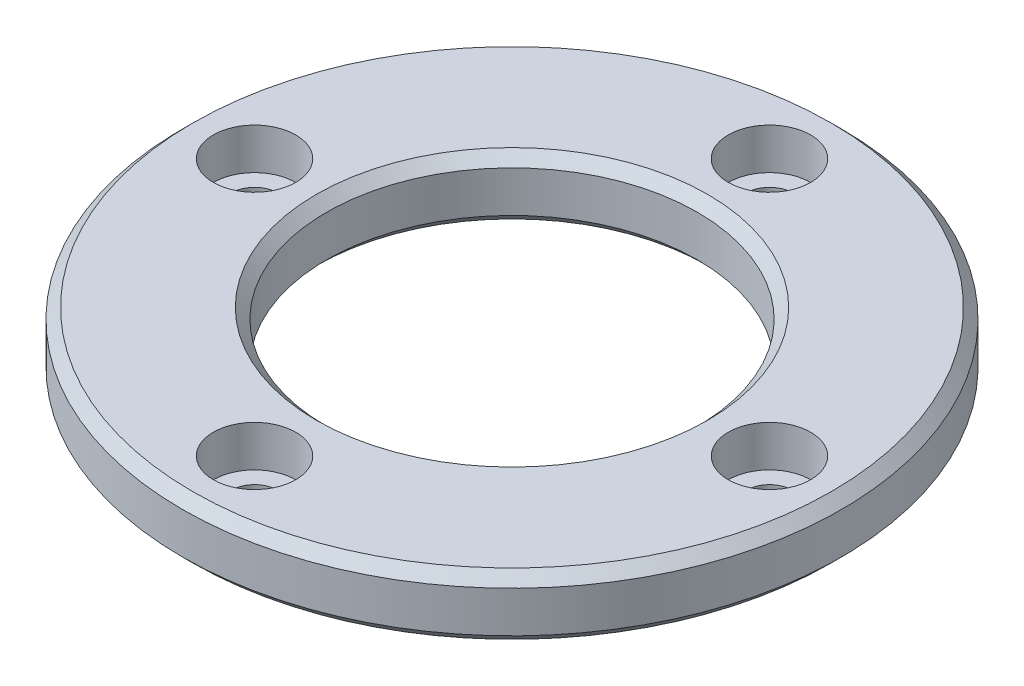
ISO-10303-21;
HEADER;
FILE_DESCRIPTION(('STEP AP214'),'2;1');
FILE_NAME('part.step','',(''),(''),'','','');
FILE_SCHEMA(('AUTOMOTIVE_DESIGN { 1 0 10303 214 1 1 1 1 }'));
ENDSEC;
DATA;
#1=APPLICATION_CONTEXT('core data for automotive mechanical design processes');
#2=APPLICATION_PROTOCOL_DEFINITION('international standard','automotive_design',2000,#1);
#3=PRODUCT_CONTEXT('',#1,'mechanical');
#4=PRODUCT('Part','Part','',(#3));
#5=PRODUCT_RELATED_PRODUCT_CATEGORY('part','',(#4));
#6=PRODUCT_DEFINITION_FORMATION('','',#4);
#7=PRODUCT_DEFINITION_CONTEXT('part definition',#1,'design');
#8=PRODUCT_DEFINITION('design','',#6,#7);
#9=PRODUCT_DEFINITION_SHAPE('','',#8);
#10=(LENGTH_UNIT() NAMED_UNIT(*) SI_UNIT(.MILLI.,.METRE.));
#11=(NAMED_UNIT(*) PLANE_ANGLE_UNIT() SI_UNIT($,.RADIAN.));
#12=(NAMED_UNIT(*) SI_UNIT($,.STERADIAN.) SOLID_ANGLE_UNIT());
#13=UNCERTAINTY_MEASURE_WITH_UNIT(LENGTH_MEASURE(1.E-05),#10,'distance_accuracy_value','');
#14=(GEOMETRIC_REPRESENTATION_CONTEXT(3) GLOBAL_UNCERTAINTY_ASSIGNED_CONTEXT((#13)) GLOBAL_UNIT_ASSIGNED_CONTEXT((#10,
#11,#12)) REPRESENTATION_CONTEXT('',''));
#15=CARTESIAN_POINT('',(0.,0.,0.));
#16=DIRECTION('',(0.,0.,1.));
#17=DIRECTION('',(1.,0.,0.));
#18=AXIS2_PLACEMENT_3D('',#15,#16,#17);
#19=CARTESIAN_POINT('',(0.,-3.,0.));
#20=DIRECTION('',(0.,1.,0.));
#21=DIRECTION('',(0.,0.,1.));
#22=AXIS2_PLACEMENT_3D('',#19,#20,#21);
#23=PLANE('',#22);
#24=CARTESIAN_POINT('',(25.,-3.,0.));
#25=DIRECTION('',(0.,1.,0.));
#26=DIRECTION('',(0.,0.,1.));
#27=AXIS2_PLACEMENT_3D('',#24,#25,#26);
#28=CIRCLE('',#27,2.99999999999999);
#29=CARTESIAN_POINT('',(25.,-3.,3.));
#30=VERTEX_POINT('',#29);
#31=EDGE_CURVE('E69',#30,#30,#28,.F.);
#32=ORIENTED_EDGE('',*,*,#31,.F.);
#33=EDGE_LOOP('',(#32));
#34=FACE_BOUND('',#33,.T.);
#35=CARTESIAN_POINT('',(-25.,-3.,0.));
#36=DIRECTION('',(0.,1.,0.));
#37=DIRECTION('',(0.,0.,1.));
#38=AXIS2_PLACEMENT_3D('',#35,#36,#37);
#39=CIRCLE('',#38,2.99999999999999);
#40=CARTESIAN_POINT('',(-25.,-3.,2.99999999999999));
#41=VERTEX_POINT('',#40);
#42=EDGE_CURVE('E81',#41,#41,#39,.F.);
#43=ORIENTED_EDGE('',*,*,#42,.F.);
#44=EDGE_LOOP('',(#43));
#45=FACE_BOUND('',#44,.T.);
#46=CARTESIAN_POINT('',(0.,-3.,0.));
#47=DIRECTION('',(0.,1.,0.));
#48=DIRECTION('',(0.,0.,1.));
#49=AXIS2_PLACEMENT_3D('',#46,#47,#48);
#50=CIRCLE('',#49,31.);
#51=CARTESIAN_POINT('',(0.,-3.,31.));
#52=VERTEX_POINT('',#51);
#53=EDGE_CURVE('E96',#52,#52,#50,.F.);
#54=ORIENTED_EDGE('',*,*,#53,.T.);
#55=EDGE_LOOP('',(#54));
#56=FACE_BOUND('',#55,.T.);
#57=CARTESIAN_POINT('',(0.,-3.,0.));
#58=DIRECTION('',(0.,1.,0.));
#59=DIRECTION('',(0.,0.,1.));
#60=AXIS2_PLACEMENT_3D('',#57,#58,#59);
#61=CIRCLE('',#60,19.);
#62=CARTESIAN_POINT('',(0.,-3.,19.));
#63=VERTEX_POINT('',#62);
#64=EDGE_CURVE('E99',#63,#63,#61,.T.);
#65=ORIENTED_EDGE('',*,*,#64,.T.);
#66=EDGE_LOOP('',(#65));
#67=FACE_BOUND('',#66,.T.);
#68=CARTESIAN_POINT('',(-2.60330291914301E-13,-3.,-25.));
#69=DIRECTION('',(0.,1.,0.));
#70=DIRECTION('',(0.,0.,1.));
#71=AXIS2_PLACEMENT_3D('',#68,#69,#70);
#72=CIRCLE('',#71,2.99999999999999);
#73=CARTESIAN_POINT('',(-2.60330291914301E-13,-3.,-22.));
#74=VERTEX_POINT('',#73);
#75=EDGE_CURVE('E72',#74,#74,#72,.F.);
#76=ORIENTED_EDGE('',*,*,#75,.F.);
#77=EDGE_LOOP('',(#76));
#78=FACE_BOUND('',#77,.T.);
#79=CARTESIAN_POINT('',(0.,-3.,25.));
#80=DIRECTION('',(0.,1.,0.));
#81=DIRECTION('',(0.,0.,1.));
#82=AXIS2_PLACEMENT_3D('',#79,#80,#81);
#83=CIRCLE('',#82,2.99999999999999);
#84=CARTESIAN_POINT('',(0.,-3.,28.));
#85=VERTEX_POINT('',#84);
#86=EDGE_CURVE('E66',#85,#85,#83,.F.);
#87=ORIENTED_EDGE('',*,*,#86,.F.);
#88=EDGE_LOOP('',(#87));
#89=FACE_BOUND('',#88,.T.);
#90=ADVANCED_FACE('F39',(#34,#45,#56,#67,#78,#89),#23,.F.);
#91=CARTESIAN_POINT('',(0.,3.,0.));
#92=DIRECTION('',(0.,1.,0.));
#93=DIRECTION('',(0.,0.,1.));
#94=AXIS2_PLACEMENT_3D('',#91,#92,#93);
#95=PLANE('',#94);
#96=CARTESIAN_POINT('',(0.,3.,0.));
#97=DIRECTION('',(0.,1.,0.));
#98=DIRECTION('',(0.,0.,1.));
#99=AXIS2_PLACEMENT_3D('',#96,#97,#98);
#100=CIRCLE('',#99,31.);
#101=CARTESIAN_POINT('',(0.,3.,31.));
#102=VERTEX_POINT('',#101);
#103=EDGE_CURVE('E90',#102,#102,#100,.T.);
#104=ORIENTED_EDGE('',*,*,#103,.T.);
#105=EDGE_LOOP('',(#104));
#106=FACE_BOUND('',#105,.T.);
#107=CARTESIAN_POINT('',(0.,3.,0.));
#108=DIRECTION('',(0.,1.,0.));
#109=DIRECTION('',(0.,0.,1.));
#110=AXIS2_PLACEMENT_3D('',#107,#108,#109);
#111=CIRCLE('',#110,19.);
#112=CARTESIAN_POINT('',(0.,3.,19.));
#113=VERTEX_POINT('',#112);
#114=EDGE_CURVE('E93',#113,#113,#111,.F.);
#115=ORIENTED_EDGE('',*,*,#114,.T.);
#116=EDGE_LOOP('',(#115));
#117=FACE_BOUND('',#116,.T.);
#118=CARTESIAN_POINT('',(0.,3.,-25.));
#119=DIRECTION('',(0.,1.,0.));
#120=DIRECTION('',(0.,0.,1.));
#121=AXIS2_PLACEMENT_3D('',#118,#119,#120);
#122=CIRCLE('',#121,3.99999999999999);
#123=CARTESIAN_POINT('',(0.,3.,-21.));
#124=VERTEX_POINT('',#123);
#125=EDGE_CURVE('E141',#124,#124,#122,.T.);
#126=ORIENTED_EDGE('',*,*,#125,.F.);
#127=EDGE_LOOP('',(#126));
#128=FACE_BOUND('',#127,.T.);
#129=CARTESIAN_POINT('',(25.,3.,0.));
#130=DIRECTION('',(0.,1.,0.));
#131=DIRECTION('',(0.,0.,1.));
#132=AXIS2_PLACEMENT_3D('',#129,#130,#131);
#133=CIRCLE('',#132,3.99999999999999);
#134=CARTESIAN_POINT('',(25.,3.,3.99999999999999));
#135=VERTEX_POINT('',#134);
#136=EDGE_CURVE('E132',#135,#135,#133,.T.);
#137=ORIENTED_EDGE('',*,*,#136,.F.);
#138=EDGE_LOOP('',(#137));
#139=FACE_BOUND('',#138,.T.);
#140=CARTESIAN_POINT('',(0.,3.,25.));
#141=DIRECTION('',(0.,1.,0.));
#142=DIRECTION('',(0.,0.,1.));
#143=AXIS2_PLACEMENT_3D('',#140,#141,#142);
#144=CIRCLE('',#143,3.99999999999999);
#145=CARTESIAN_POINT('',(0.,3.,29.));
#146=VERTEX_POINT('',#145);
#147=EDGE_CURVE('E123',#146,#146,#144,.T.);
#148=ORIENTED_EDGE('',*,*,#147,.F.);
#149=EDGE_LOOP('',(#148));
#150=FACE_BOUND('',#149,.T.);
#151=CARTESIAN_POINT('',(-25.,3.,0.));
#152=DIRECTION('',(0.,1.,0.));
#153=DIRECTION('',(0.,0.,1.));
#154=AXIS2_PLACEMENT_3D('',#151,#152,#153);
#155=CIRCLE('',#154,3.99999999999999);
#156=CARTESIAN_POINT('',(-25.,3.,3.99999999999999));
#157=VERTEX_POINT('',#156);
#158=EDGE_CURVE('E114',#157,#157,#155,.T.);
#159=ORIENTED_EDGE('',*,*,#158,.F.);
#160=EDGE_LOOP('',(#159));
#161=FACE_BOUND('',#160,.T.);
#162=ADVANCED_FACE('F176',(#106,#117,#128,#139,#150,#161),#95,.T.);
#163=CARTESIAN_POINT('',(0.,3.,0.));
#164=DIRECTION('',(0.,-1.,0.));
#165=DIRECTION('',(0.,0.,-1.));
#166=AXIS2_PLACEMENT_3D('',#163,#164,#165);
#167=CYLINDRICAL_SURFACE('',#166,32.);
#168=CARTESIAN_POINT('',(0.,-2.00000000000001,0.));
#169=DIRECTION('',(0.,1.,0.));
#170=DIRECTION('',(0.,0.,1.));
#171=AXIS2_PLACEMENT_3D('',#168,#169,#170);
#172=CIRCLE('',#171,32.);
#173=CARTESIAN_POINT('',(0.,-2.00000000000001,32.));
#174=VERTEX_POINT('',#173);
#175=EDGE_CURVE('E102',#174,#174,#172,.T.);
#176=ORIENTED_EDGE('',*,*,#175,.T.);
#177=EDGE_LOOP('',(#176));
#178=FACE_BOUND('',#177,.T.);
#179=CARTESIAN_POINT('',(0.,1.99999999999997,0.));
#180=DIRECTION('',(0.,1.,0.));
#181=DIRECTION('',(0.,0.,1.));
#182=AXIS2_PLACEMENT_3D('',#179,#180,#181);
#183=CIRCLE('',#182,32.);
#184=CARTESIAN_POINT('',(0.,1.99999999999997,32.));
#185=VERTEX_POINT('',#184);
#186=EDGE_CURVE('E105',#185,#185,#183,.F.);
#187=ORIENTED_EDGE('',*,*,#186,.T.);
#188=EDGE_LOOP('',(#187));
#189=FACE_BOUND('',#188,.T.);
#190=ADVANCED_FACE('F184',(#178,#189),#167,.T.);
#191=CARTESIAN_POINT('',(0.,3.,0.));
#192=DIRECTION('',(0.,-1.,0.));
#193=DIRECTION('',(0.,0.,-1.));
#194=AXIS2_PLACEMENT_3D('',#191,#192,#193);
#195=CYLINDRICAL_SURFACE('',#194,18.);
#196=CARTESIAN_POINT('',(0.,-2.00000000000001,0.));
#197=DIRECTION('',(0.,1.,0.));
#198=DIRECTION('',(0.,0.,1.));
#199=AXIS2_PLACEMENT_3D('',#196,#197,#198);
#200=CIRCLE('',#199,18.);
#201=CARTESIAN_POINT('',(0.,-2.00000000000001,18.));
#202=VERTEX_POINT('',#201);
#203=EDGE_CURVE('E84',#202,#202,#200,.F.);
#204=ORIENTED_EDGE('',*,*,#203,.T.);
#205=EDGE_LOOP('',(#204));
#206=FACE_BOUND('',#205,.T.);
#207=CARTESIAN_POINT('',(0.,2.,0.));
#208=DIRECTION('',(0.,1.,0.));
#209=DIRECTION('',(0.,0.,1.));
#210=AXIS2_PLACEMENT_3D('',#207,#208,#209);
#211=CIRCLE('',#210,18.);
#212=CARTESIAN_POINT('',(0.,2.,18.));
#213=VERTEX_POINT('',#212);
#214=EDGE_CURVE('E87',#213,#213,#211,.T.);
#215=ORIENTED_EDGE('',*,*,#214,.T.);
#216=EDGE_LOOP('',(#215));
#217=FACE_BOUND('',#216,.T.);
#218=ADVANCED_FACE('F193',(#206,#217),#195,.F.);
#219=CARTESIAN_POINT('',(-25.,3.,0.));
#220=DIRECTION('',(0.,1.,0.));
#221=DIRECTION('',(0.,0.,1.));
#222=AXIS2_PLACEMENT_3D('',#219,#220,#221);
#223=CYLINDRICAL_SURFACE('',#222,2.25);
#224=CARTESIAN_POINT('',(-25.,-1.,0.));
#225=DIRECTION('',(0.,1.,0.));
#226=DIRECTION('',(0.,0.,1.));
#227=AXIS2_PLACEMENT_3D('',#224,#225,#226);
#228=CIRCLE('',#227,2.25);
#229=CARTESIAN_POINT('',(-25.,-1.,2.25));
#230=VERTEX_POINT('',#229);
#231=EDGE_CURVE('E108',#230,#230,#228,.T.);
#232=ORIENTED_EDGE('',*,*,#231,.T.);
#233=EDGE_LOOP('',(#232));
#234=FACE_BOUND('',#233,.T.);
#235=CARTESIAN_POINT('',(-25.,-5.,0.));
#236=DIRECTION('',(0.,-1.,0.));
#237=DIRECTION('',(0.,0.,-1.));
#238=AXIS2_PLACEMENT_3D('',#235,#236,#237);
#239=CIRCLE('',#238,2.25);
#240=CARTESIAN_POINT('',(-25.,-5.,-2.25));
#241=VERTEX_POINT('',#240);
#242=EDGE_CURVE('E144',#241,#241,#239,.T.);
#243=ORIENTED_EDGE('',*,*,#242,.T.);
#244=EDGE_LOOP('',(#243));
#245=FACE_BOUND('',#244,.T.);
#246=ADVANCED_FACE('F289',(#234,#245),#223,.F.);
#247=CARTESIAN_POINT('',(-22.75,-1.,0.));
#248=DIRECTION('',(0.,-1.,0.));
#249=DIRECTION('',(0.,0.,-1.));
#250=AXIS2_PLACEMENT_3D('',#247,#248,#249);
#251=PLANE('',#250);
#252=ORIENTED_EDGE('',*,*,#231,.F.);
#253=EDGE_LOOP('',(#252));
#254=FACE_BOUND('',#253,.T.);
#255=CARTESIAN_POINT('',(-25.,-1.,0.));
#256=DIRECTION('',(0.,1.,0.));
#257=DIRECTION('',(0.,0.,1.));
#258=AXIS2_PLACEMENT_3D('',#255,#256,#257);
#259=CIRCLE('',#258,4.);
#260=CARTESIAN_POINT('',(-25.,-1.,3.99999999999999));
#261=VERTEX_POINT('',#260);
#262=EDGE_CURVE('E111',#261,#261,#259,.T.);
#263=ORIENTED_EDGE('',*,*,#262,.T.);
#264=EDGE_LOOP('',(#263));
#265=FACE_BOUND('',#264,.T.);
#266=ADVANCED_FACE('F285',(#254,#265),#251,.F.);
#267=CARTESIAN_POINT('',(-25.,3.,0.));
#268=DIRECTION('',(0.,1.,0.));
#269=DIRECTION('',(0.,0.,1.));
#270=AXIS2_PLACEMENT_3D('',#267,#268,#269);
#271=CYLINDRICAL_SURFACE('',#270,3.99999999999999);
#272=ORIENTED_EDGE('',*,*,#262,.F.);
#273=EDGE_LOOP('',(#272));
#274=FACE_BOUND('',#273,.T.);
#275=ORIENTED_EDGE('',*,*,#158,.T.);
#276=EDGE_LOOP('',(#275));
#277=FACE_BOUND('',#276,.T.);
#278=ADVANCED_FACE('F281',(#274,#277),#271,.F.);
#279=CARTESIAN_POINT('',(0.,3.,25.));
#280=DIRECTION('',(0.,1.,0.));
#281=DIRECTION('',(0.,0.,1.));
#282=AXIS2_PLACEMENT_3D('',#279,#280,#281);
#283=CYLINDRICAL_SURFACE('',#282,2.25);
#284=CARTESIAN_POINT('',(0.,-1.,25.));
#285=DIRECTION('',(0.,1.,0.));
#286=DIRECTION('',(0.,0.,1.));
#287=AXIS2_PLACEMENT_3D('',#284,#285,#286);
#288=CIRCLE('',#287,2.25);
#289=CARTESIAN_POINT('',(0.,-1.,27.25));
#290=VERTEX_POINT('',#289);
#291=EDGE_CURVE('E117',#290,#290,#288,.T.);
#292=ORIENTED_EDGE('',*,*,#291,.T.);
#293=EDGE_LOOP('',(#292));
#294=FACE_BOUND('',#293,.T.);
#295=CARTESIAN_POINT('',(0.,-5.,25.));
#296=DIRECTION('',(0.,-1.,0.));
#297=DIRECTION('',(-1.,0.,0.));
#298=AXIS2_PLACEMENT_3D('',#295,#296,#297);
#299=CIRCLE('',#298,2.25);
#300=CARTESIAN_POINT('',(-2.24999999999991,-5.,25.));
#301=VERTEX_POINT('',#300);
#302=EDGE_CURVE('E147',#301,#301,#299,.T.);
#303=ORIENTED_EDGE('',*,*,#302,.T.);
#304=EDGE_LOOP('',(#303));
#305=FACE_BOUND('',#304,.T.);
#306=ADVANCED_FACE('F157',(#294,#305),#283,.F.);
#307=CARTESIAN_POINT('',(2.25,-1.,25.));
#308=DIRECTION('',(0.,-1.,0.));
#309=DIRECTION('',(0.,0.,-1.));
#310=AXIS2_PLACEMENT_3D('',#307,#308,#309);
#311=PLANE('',#310);
#312=ORIENTED_EDGE('',*,*,#291,.F.);
#313=EDGE_LOOP('',(#312));
#314=FACE_BOUND('',#313,.T.);
#315=CARTESIAN_POINT('',(0.,-1.,25.));
#316=DIRECTION('',(0.,1.,0.));
#317=DIRECTION('',(0.,0.,1.));
#318=AXIS2_PLACEMENT_3D('',#315,#316,#317);
#319=CIRCLE('',#318,4.);
#320=CARTESIAN_POINT('',(0.,-1.,29.));
#321=VERTEX_POINT('',#320);
#322=EDGE_CURVE('E120',#321,#321,#319,.T.);
#323=ORIENTED_EDGE('',*,*,#322,.T.);
#324=EDGE_LOOP('',(#323));
#325=FACE_BOUND('',#324,.T.);
#326=ADVANCED_FACE('F272',(#314,#325),#311,.F.);
#327=CARTESIAN_POINT('',(0.,3.,25.));
#328=DIRECTION('',(0.,1.,0.));
#329=DIRECTION('',(0.,0.,1.));
#330=AXIS2_PLACEMENT_3D('',#327,#328,#329);
#331=CYLINDRICAL_SURFACE('',#330,3.99999999999999);
#332=ORIENTED_EDGE('',*,*,#322,.F.);
#333=EDGE_LOOP('',(#332));
#334=FACE_BOUND('',#333,.T.);
#335=ORIENTED_EDGE('',*,*,#147,.T.);
#336=EDGE_LOOP('',(#335));
#337=FACE_BOUND('',#336,.T.);
#338=ADVANCED_FACE('F261',(#334,#337),#331,.F.);
#339=CARTESIAN_POINT('',(25.,3.,0.));
#340=DIRECTION('',(0.,1.,0.));
#341=DIRECTION('',(0.,0.,1.));
#342=AXIS2_PLACEMENT_3D('',#339,#340,#341);
#343=CYLINDRICAL_SURFACE('',#342,2.25);
#344=CARTESIAN_POINT('',(25.,-1.,0.));
#345=DIRECTION('',(0.,1.,0.));
#346=DIRECTION('',(0.,0.,1.));
#347=AXIS2_PLACEMENT_3D('',#344,#345,#346);
#348=CIRCLE('',#347,2.25);
#349=CARTESIAN_POINT('',(25.,-1.,2.25));
#350=VERTEX_POINT('',#349);
#351=EDGE_CURVE('E126',#350,#350,#348,.T.);
#352=ORIENTED_EDGE('',*,*,#351,.T.);
#353=EDGE_LOOP('',(#352));
#354=FACE_BOUND('',#353,.T.);
#355=CARTESIAN_POINT('',(25.,-5.,0.));
#356=DIRECTION('',(0.,-1.,0.));
#357=DIRECTION('',(0.,0.,1.));
#358=AXIS2_PLACEMENT_3D('',#355,#356,#357);
#359=CIRCLE('',#358,2.25);
#360=CARTESIAN_POINT('',(25.,-5.,2.25));
#361=VERTEX_POINT('',#360);
#362=EDGE_CURVE('E151',#361,#361,#359,.T.);
#363=ORIENTED_EDGE('',*,*,#362,.T.);
#364=EDGE_LOOP('',(#363));
#365=FACE_BOUND('',#364,.T.);
#366=ADVANCED_FACE('F258',(#354,#365),#343,.F.);
#367=CARTESIAN_POINT('',(27.25,-1.,0.));
#368=DIRECTION('',(0.,-1.,0.));
#369=DIRECTION('',(0.,0.,-1.));
#370=AXIS2_PLACEMENT_3D('',#367,#368,#369);
#371=PLANE('',#370);
#372=ORIENTED_EDGE('',*,*,#351,.F.);
#373=EDGE_LOOP('',(#372));
#374=FACE_BOUND('',#373,.T.);
#375=CARTESIAN_POINT('',(25.,-1.,0.));
#376=DIRECTION('',(0.,1.,0.));
#377=DIRECTION('',(0.,0.,1.));
#378=AXIS2_PLACEMENT_3D('',#375,#376,#377);
#379=CIRCLE('',#378,4.);
#380=CARTESIAN_POINT('',(25.,-1.,3.99999999999999));
#381=VERTEX_POINT('',#380);
#382=EDGE_CURVE('E129',#381,#381,#379,.T.);
#383=ORIENTED_EDGE('',*,*,#382,.T.);
#384=EDGE_LOOP('',(#383));
#385=FACE_BOUND('',#384,.T.);
#386=ADVANCED_FACE('F260',(#374,#385),#371,.F.);
#387=CARTESIAN_POINT('',(25.,3.,0.));
#388=DIRECTION('',(0.,1.,0.));
#389=DIRECTION('',(0.,0.,1.));
#390=AXIS2_PLACEMENT_3D('',#387,#388,#389);
#391=CYLINDRICAL_SURFACE('',#390,3.99999999999999);
#392=ORIENTED_EDGE('',*,*,#382,.F.);
#393=EDGE_LOOP('',(#392));
#394=FACE_BOUND('',#393,.T.);
#395=ORIENTED_EDGE('',*,*,#136,.T.);
#396=EDGE_LOOP('',(#395));
#397=FACE_BOUND('',#396,.T.);
#398=ADVANCED_FACE('F268',(#394,#397),#391,.F.);
#399=CARTESIAN_POINT('',(0.,3.,-25.));
#400=DIRECTION('',(0.,1.,0.));
#401=DIRECTION('',(0.,0.,1.));
#402=AXIS2_PLACEMENT_3D('',#399,#400,#401);
#403=CYLINDRICAL_SURFACE('',#402,2.25);
#404=CARTESIAN_POINT('',(0.,-1.,-25.));
#405=DIRECTION('',(0.,1.,0.));
#406=DIRECTION('',(0.,0.,1.));
#407=AXIS2_PLACEMENT_3D('',#404,#405,#406);
#408=CIRCLE('',#407,2.25);
#409=CARTESIAN_POINT('',(0.,-1.,-22.75));
#410=VERTEX_POINT('',#409);
#411=EDGE_CURVE('E135',#410,#410,#408,.T.);
#412=ORIENTED_EDGE('',*,*,#411,.T.);
#413=EDGE_LOOP('',(#412));
#414=FACE_BOUND('',#413,.T.);
#415=CARTESIAN_POINT('',(-2.60330291914301E-13,-5.,-25.));
#416=DIRECTION('',(0.,-1.,0.));
#417=DIRECTION('',(1.,0.,0.));
#418=AXIS2_PLACEMENT_3D('',#415,#416,#417);
#419=CIRCLE('',#418,2.25);
#420=CARTESIAN_POINT('',(2.24999999999974,-5.,-25.));
#421=VERTEX_POINT('',#420);
#422=EDGE_CURVE('E148',#421,#421,#419,.T.);
#423=ORIENTED_EDGE('',*,*,#422,.T.);
#424=EDGE_LOOP('',(#423));
#425=FACE_BOUND('',#424,.T.);
#426=ADVANCED_FACE('F329',(#414,#425),#403,.F.);
#427=CARTESIAN_POINT('',(2.25,-1.,-25.));
#428=DIRECTION('',(0.,-1.,0.));
#429=DIRECTION('',(0.,0.,-1.));
#430=AXIS2_PLACEMENT_3D('',#427,#428,#429);
#431=PLANE('',#430);
#432=ORIENTED_EDGE('',*,*,#411,.F.);
#433=EDGE_LOOP('',(#432));
#434=FACE_BOUND('',#433,.T.);
#435=CARTESIAN_POINT('',(0.,-1.,-25.));
#436=DIRECTION('',(0.,1.,0.));
#437=DIRECTION('',(0.,0.,1.));
#438=AXIS2_PLACEMENT_3D('',#435,#436,#437);
#439=CIRCLE('',#438,4.);
#440=CARTESIAN_POINT('',(0.,-1.,-21.));
#441=VERTEX_POINT('',#440);
#442=EDGE_CURVE('E138',#441,#441,#439,.T.);
#443=ORIENTED_EDGE('',*,*,#442,.T.);
#444=EDGE_LOOP('',(#443));
#445=FACE_BOUND('',#444,.T.);
#446=ADVANCED_FACE('F325',(#434,#445),#431,.F.);
#447=CARTESIAN_POINT('',(0.,3.,-25.));
#448=DIRECTION('',(0.,1.,0.));
#449=DIRECTION('',(0.,0.,1.));
#450=AXIS2_PLACEMENT_3D('',#447,#448,#449);
#451=CYLINDRICAL_SURFACE('',#450,3.99999999999999);
#452=ORIENTED_EDGE('',*,*,#442,.F.);
#453=EDGE_LOOP('',(#452));
#454=FACE_BOUND('',#453,.T.);
#455=ORIENTED_EDGE('',*,*,#125,.T.);
#456=EDGE_LOOP('',(#455));
#457=FACE_BOUND('',#456,.T.);
#458=ADVANCED_FACE('F203',(#454,#457),#451,.F.);
#459=CARTESIAN_POINT('',(0.,-2.00000000000001,0.));
#460=DIRECTION('',(0.,1.,0.));
#461=DIRECTION('',(0.,0.,1.));
#462=AXIS2_PLACEMENT_3D('',#459,#460,#461);
#463=CONICAL_SURFACE('',#462,32.,0.785398163397448);
#464=ORIENTED_EDGE('',*,*,#53,.F.);
#465=EDGE_LOOP('',(#464));
#466=FACE_BOUND('',#465,.T.);
#467=ORIENTED_EDGE('',*,*,#175,.F.);
#468=EDGE_LOOP('',(#467));
#469=FACE_BOUND('',#468,.T.);
#470=ADVANCED_FACE('F196',(#466,#469),#463,.T.);
#471=CARTESIAN_POINT('',(0.,3.,0.));
#472=DIRECTION('',(0.,-1.,0.));
#473=DIRECTION('',(0.,0.,-1.));
#474=AXIS2_PLACEMENT_3D('',#471,#472,#473);
#475=CONICAL_SURFACE('',#474,31.,0.785398163397441);
#476=ORIENTED_EDGE('',*,*,#186,.F.);
#477=EDGE_LOOP('',(#476));
#478=FACE_BOUND('',#477,.T.);
#479=ORIENTED_EDGE('',*,*,#103,.F.);
#480=EDGE_LOOP('',(#479));
#481=FACE_BOUND('',#480,.T.);
#482=ADVANCED_FACE('F202',(#478,#481),#475,.T.);
#483=CARTESIAN_POINT('',(0.,-3.,0.));
#484=DIRECTION('',(0.,-1.,0.));
#485=DIRECTION('',(0.,0.,-1.));
#486=AXIS2_PLACEMENT_3D('',#483,#484,#485);
#487=CONICAL_SURFACE('',#486,19.,0.785398163397448);
#488=ORIENTED_EDGE('',*,*,#203,.F.);
#489=EDGE_LOOP('',(#488));
#490=FACE_BOUND('',#489,.T.);
#491=ORIENTED_EDGE('',*,*,#64,.F.);
#492=EDGE_LOOP('',(#491));
#493=FACE_BOUND('',#492,.T.);
#494=ADVANCED_FACE('F210',(#490,#493),#487,.F.);
#495=CARTESIAN_POINT('',(0.,2.,0.));
#496=DIRECTION('',(0.,1.,0.));
#497=DIRECTION('',(0.,0.,1.));
#498=AXIS2_PLACEMENT_3D('',#495,#496,#497);
#499=CONICAL_SURFACE('',#498,18.,0.785398163397452);
#500=ORIENTED_EDGE('',*,*,#114,.F.);
#501=EDGE_LOOP('',(#500));
#502=FACE_BOUND('',#501,.T.);
#503=ORIENTED_EDGE('',*,*,#214,.F.);
#504=EDGE_LOOP('',(#503));
#505=FACE_BOUND('',#504,.T.);
#506=ADVANCED_FACE('F217',(#502,#505),#499,.F.);
#507=CARTESIAN_POINT('',(-25.,-5.,0.));
#508=DIRECTION('',(0.,-1.,0.));
#509=DIRECTION('',(0.,0.,-1.));
#510=AXIS2_PLACEMENT_3D('',#507,#508,#509);
#511=PLANE('',#510);
#512=CARTESIAN_POINT('',(-25.,-5.,0.));
#513=DIRECTION('',(0.,-1.,0.));
#514=DIRECTION('',(0.,0.,-1.));
#515=AXIS2_PLACEMENT_3D('',#512,#513,#514);
#516=CIRCLE('',#515,2.8);
#517=CARTESIAN_POINT('',(-25.,-5.,-2.8));
#518=VERTEX_POINT('',#517);
#519=EDGE_CURVE('E78',#518,#518,#516,.T.);
#520=ORIENTED_EDGE('',*,*,#519,.T.);
#521=EDGE_LOOP('',(#520));
#522=FACE_BOUND('',#521,.T.);
#523=ORIENTED_EDGE('',*,*,#242,.F.);
#524=EDGE_LOOP('',(#523));
#525=FACE_BOUND('',#524,.T.);
#526=ADVANCED_FACE('F224',(#522,#525),#511,.T.);
#527=CARTESIAN_POINT('',(-25.,-5.,0.));
#528=DIRECTION('',(0.,1.,0.));
#529=DIRECTION('',(0.,0.,1.));
#530=AXIS2_PLACEMENT_3D('',#527,#528,#529);
#531=CYLINDRICAL_SURFACE('',#530,2.99999999999999);
#532=CARTESIAN_POINT('',(-25.,-4.8,0.));
#533=DIRECTION('',(0.,-1.,0.));
#534=DIRECTION('',(0.,0.,-1.));
#535=AXIS2_PLACEMENT_3D('',#532,#533,#534);
#536=CIRCLE('',#535,2.99999999999999);
#537=CARTESIAN_POINT('',(-25.,-4.8,-3.));
#538=VERTEX_POINT('',#537);
#539=EDGE_CURVE('E75',#538,#538,#536,.F.);
#540=ORIENTED_EDGE('',*,*,#539,.T.);
#541=EDGE_LOOP('',(#540));
#542=FACE_BOUND('',#541,.T.);
#543=ORIENTED_EDGE('',*,*,#42,.T.);
#544=EDGE_LOOP('',(#543));
#545=FACE_BOUND('',#544,.T.);
#546=ADVANCED_FACE('F232',(#542,#545),#531,.T.);
#547=CARTESIAN_POINT('',(-25.,-5.,0.));
#548=DIRECTION('',(0.,1.,0.));
#549=DIRECTION('',(0.,0.,1.));
#550=AXIS2_PLACEMENT_3D('',#547,#548,#549);
#551=CONICAL_SURFACE('',#550,2.8,0.785398163397444);
#552=ORIENTED_EDGE('',*,*,#539,.F.);
#553=EDGE_LOOP('',(#552));
#554=FACE_BOUND('',#553,.T.);
#555=ORIENTED_EDGE('',*,*,#519,.F.);
#556=EDGE_LOOP('',(#555));
#557=FACE_BOUND('',#556,.T.);
#558=ADVANCED_FACE('F226',(#554,#557),#551,.T.);
#559=CARTESIAN_POINT('',(-2.60330291914301E-13,-5.,-25.));
#560=DIRECTION('',(0.,-1.,0.));
#561=DIRECTION('',(1.,0.,0.));
#562=AXIS2_PLACEMENT_3D('',#559,#560,#561);
#563=PLANE('',#562);
#564=CARTESIAN_POINT('',(-2.60330291914301E-13,-5.,-25.));
#565=DIRECTION('',(0.,-1.,0.));
#566=DIRECTION('',(0.,0.,-1.));
#567=AXIS2_PLACEMENT_3D('',#564,#565,#566);
#568=CIRCLE('',#567,2.8);
#569=CARTESIAN_POINT('',(-2.60330291914301E-13,-5.,-27.8));
#570=VERTEX_POINT('',#569);
#571=EDGE_CURVE('E47',#570,#570,#568,.T.);
#572=ORIENTED_EDGE('',*,*,#571,.T.);
#573=EDGE_LOOP('',(#572));
#574=FACE_BOUND('',#573,.T.);
#575=ORIENTED_EDGE('',*,*,#422,.F.);
#576=EDGE_LOOP('',(#575));
#577=FACE_BOUND('',#576,.T.);
#578=ADVANCED_FACE('F231',(#574,#577),#563,.T.);
#579=CARTESIAN_POINT('',(-2.60330291914301E-13,-5.,-25.));
#580=DIRECTION('',(0.,1.,0.));
#581=DIRECTION('',(0.,0.,1.));
#582=AXIS2_PLACEMENT_3D('',#579,#580,#581);
#583=CYLINDRICAL_SURFACE('',#582,2.99999999999999);
#584=CARTESIAN_POINT('',(-2.60330291914301E-13,-4.8,-25.));
#585=DIRECTION('',(0.,-1.,0.));
#586=DIRECTION('',(0.,0.,-1.));
#587=AXIS2_PLACEMENT_3D('',#584,#585,#586);
#588=CIRCLE('',#587,2.99999999999999);
#589=CARTESIAN_POINT('',(-2.60330291914301E-13,-4.8,-28.));
#590=VERTEX_POINT('',#589);
#591=EDGE_CURVE('E10',#590,#590,#588,.F.);
#592=ORIENTED_EDGE('',*,*,#591,.T.);
#593=EDGE_LOOP('',(#592));
#594=FACE_BOUND('',#593,.T.);
#595=ORIENTED_EDGE('',*,*,#75,.T.);
#596=EDGE_LOOP('',(#595));
#597=FACE_BOUND('',#596,.T.);
#598=ADVANCED_FACE('F254',(#594,#597),#583,.T.);
#599=CARTESIAN_POINT('',(25.,-5.,0.));
#600=DIRECTION('',(0.,-1.,0.));
#601=DIRECTION('',(0.,0.,1.));
#602=AXIS2_PLACEMENT_3D('',#599,#600,#601);
#603=PLANE('',#602);
#604=CARTESIAN_POINT('',(25.,-5.,0.));
#605=DIRECTION('',(0.,-1.,0.));
#606=DIRECTION('',(0.,0.,-1.));
#607=AXIS2_PLACEMENT_3D('',#604,#605,#606);
#608=CIRCLE('',#607,2.8);
#609=CARTESIAN_POINT('',(25.,-5.,-2.8));
#610=VERTEX_POINT('',#609);
#611=EDGE_CURVE('E55',#610,#610,#608,.T.);
#612=ORIENTED_EDGE('',*,*,#611,.T.);
#613=EDGE_LOOP('',(#612));
#614=FACE_BOUND('',#613,.T.);
#615=ORIENTED_EDGE('',*,*,#362,.F.);
#616=EDGE_LOOP('',(#615));
#617=FACE_BOUND('',#616,.T.);
#618=ADVANCED_FACE('F172',(#614,#617),#603,.T.);
#619=CARTESIAN_POINT('',(25.,-5.,0.));
#620=DIRECTION('',(0.,1.,0.));
#621=DIRECTION('',(0.,0.,1.));
#622=AXIS2_PLACEMENT_3D('',#619,#620,#621);
#623=CYLINDRICAL_SURFACE('',#622,2.99999999999999);
#624=CARTESIAN_POINT('',(25.,-4.8,0.));
#625=DIRECTION('',(0.,-1.,0.));
#626=DIRECTION('',(0.,0.,-1.));
#627=AXIS2_PLACEMENT_3D('',#624,#625,#626);
#628=CIRCLE('',#627,2.99999999999999);
#629=CARTESIAN_POINT('',(25.,-4.8,-2.99999999999999));
#630=VERTEX_POINT('',#629);
#631=EDGE_CURVE('E51',#630,#630,#628,.F.);
#632=ORIENTED_EDGE('',*,*,#631,.T.);
#633=EDGE_LOOP('',(#632));
#634=FACE_BOUND('',#633,.T.);
#635=ORIENTED_EDGE('',*,*,#31,.T.);
#636=EDGE_LOOP('',(#635));
#637=FACE_BOUND('',#636,.T.);
#638=ADVANCED_FACE('F162',(#634,#637),#623,.T.);
#639=CARTESIAN_POINT('',(0.,-5.,25.));
#640=DIRECTION('',(0.,-1.,0.));
#641=DIRECTION('',(-1.,0.,0.));
#642=AXIS2_PLACEMENT_3D('',#639,#640,#641);
#643=PLANE('',#642);
#644=CARTESIAN_POINT('',(0.,-5.,25.));
#645=DIRECTION('',(0.,-1.,0.));
#646=DIRECTION('',(0.,0.,-1.));
#647=AXIS2_PLACEMENT_3D('',#644,#645,#646);
#648=CIRCLE('',#647,2.8);
#649=CARTESIAN_POINT('',(0.,-5.,22.2));
#650=VERTEX_POINT('',#649);
#651=EDGE_CURVE('E63',#650,#650,#648,.T.);
#652=ORIENTED_EDGE('',*,*,#651,.T.);
#653=EDGE_LOOP('',(#652));
#654=FACE_BOUND('',#653,.T.);
#655=ORIENTED_EDGE('',*,*,#302,.F.);
#656=EDGE_LOOP('',(#655));
#657=FACE_BOUND('',#656,.T.);
#658=ADVANCED_FACE('F159',(#654,#657),#643,.T.);
#659=CARTESIAN_POINT('',(0.,-5.,25.));
#660=DIRECTION('',(0.,1.,0.));
#661=DIRECTION('',(0.,0.,1.));
#662=AXIS2_PLACEMENT_3D('',#659,#660,#661);
#663=CYLINDRICAL_SURFACE('',#662,2.99999999999999);
#664=CARTESIAN_POINT('',(0.,-4.8,25.));
#665=DIRECTION('',(0.,-1.,0.));
#666=DIRECTION('',(0.,0.,-1.));
#667=AXIS2_PLACEMENT_3D('',#664,#665,#666);
#668=CIRCLE('',#667,2.99999999999999);
#669=CARTESIAN_POINT('',(0.,-4.8,22.));
#670=VERTEX_POINT('',#669);
#671=EDGE_CURVE('E60',#670,#670,#668,.F.);
#672=ORIENTED_EDGE('',*,*,#671,.T.);
#673=EDGE_LOOP('',(#672));
#674=FACE_BOUND('',#673,.T.);
#675=ORIENTED_EDGE('',*,*,#86,.T.);
#676=EDGE_LOOP('',(#675));
#677=FACE_BOUND('',#676,.T.);
#678=ADVANCED_FACE('F161',(#674,#677),#663,.T.);
#679=CARTESIAN_POINT('',(0.,-5.,25.));
#680=DIRECTION('',(0.,1.,0.));
#681=DIRECTION('',(0.,0.,1.));
#682=AXIS2_PLACEMENT_3D('',#679,#680,#681);
#683=CONICAL_SURFACE('',#682,2.8,0.785398163397444);
#684=ORIENTED_EDGE('',*,*,#671,.F.);
#685=EDGE_LOOP('',(#684));
#686=FACE_BOUND('',#685,.T.);
#687=ORIENTED_EDGE('',*,*,#651,.F.);
#688=EDGE_LOOP('',(#687));
#689=FACE_BOUND('',#688,.T.);
#690=ADVANCED_FACE('F169',(#686,#689),#683,.T.);
#691=CARTESIAN_POINT('',(25.,-5.,0.));
#692=DIRECTION('',(0.,1.,0.));
#693=DIRECTION('',(0.,0.,1.));
#694=AXIS2_PLACEMENT_3D('',#691,#692,#693);
#695=CONICAL_SURFACE('',#694,2.8,0.785398163397444);
#696=ORIENTED_EDGE('',*,*,#631,.F.);
#697=EDGE_LOOP('',(#696));
#698=FACE_BOUND('',#697,.T.);
#699=ORIENTED_EDGE('',*,*,#611,.F.);
#700=EDGE_LOOP('',(#699));
#701=FACE_BOUND('',#700,.T.);
#702=ADVANCED_FACE('F238',(#698,#701),#695,.T.);
#703=CARTESIAN_POINT('',(-2.60330291914301E-13,-5.,-25.));
#704=DIRECTION('',(0.,1.,0.));
#705=DIRECTION('',(0.,0.,1.));
#706=AXIS2_PLACEMENT_3D('',#703,#704,#705);
#707=CONICAL_SURFACE('',#706,2.8,0.785398163397444);
#708=ORIENTED_EDGE('',*,*,#591,.F.);
#709=EDGE_LOOP('',(#708));
#710=FACE_BOUND('',#709,.T.);
#711=ORIENTED_EDGE('',*,*,#571,.F.);
#712=EDGE_LOOP('',(#711));
#713=FACE_BOUND('',#712,.T.);
#714=ADVANCED_FACE('F42',(#710,#713),#707,.T.);
#715=CLOSED_SHELL('',(#90,#162,#190,#218,#246,#266,#278,#306,#326,#338,#366,#386,#398,#426,#446,
#458,#470,#482,#494,#506,#526,#546,#558,#578,#598,#618,#638,#658,#678,#690,#702,#714));
#716=MANIFOLD_SOLID_BREP('B2',#715);
#717=ADVANCED_BREP_SHAPE_REPRESENTATION('',(#18,#716),#14);
#718=SHAPE_DEFINITION_REPRESENTATION(#9,#717);
ENDSEC;
END-ISO-10303-21;
